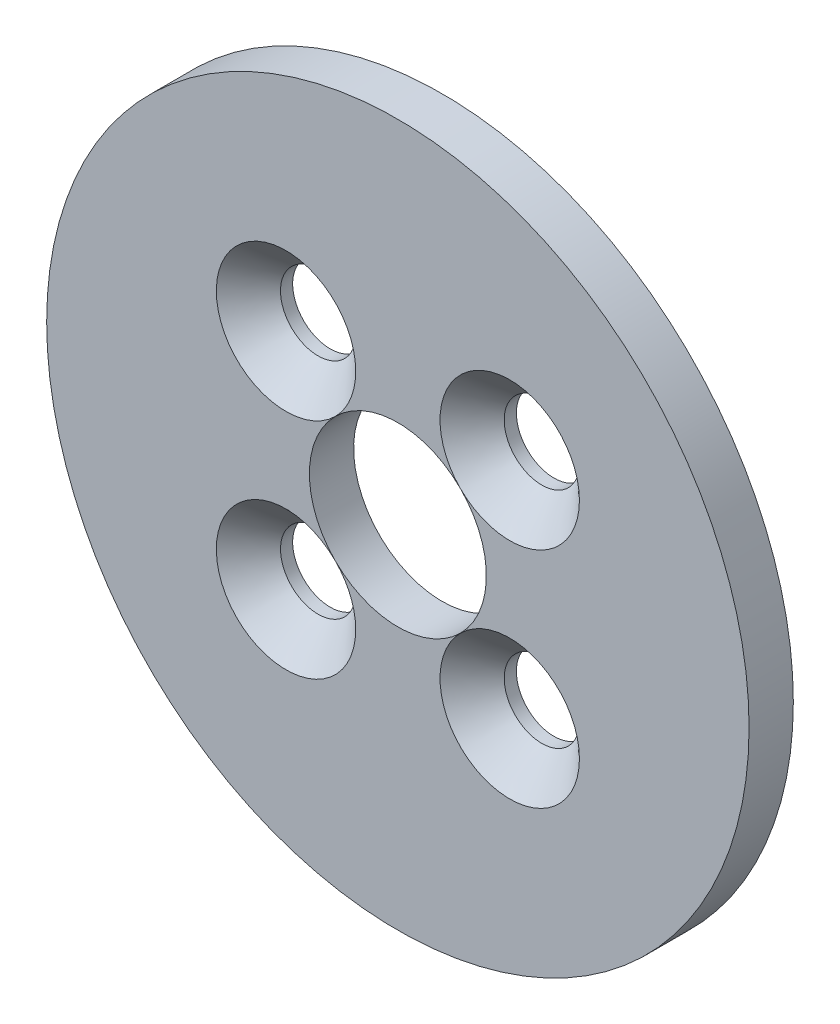
ISO-10303-21;
HEADER;
FILE_DESCRIPTION(('STEP AP214'),'2;1');
FILE_NAME('part.step','',(''),(''),'','','');
FILE_SCHEMA(('AUTOMOTIVE_DESIGN { 1 0 10303 214 1 1 1 1 }'));
ENDSEC;
DATA;
#1=APPLICATION_CONTEXT('core data for automotive mechanical design processes');
#2=APPLICATION_PROTOCOL_DEFINITION('international standard','automotive_design',2000,#1);
#3=PRODUCT_CONTEXT('',#1,'mechanical');
#4=PRODUCT('Part','Part','',(#3));
#5=PRODUCT_RELATED_PRODUCT_CATEGORY('part','',(#4));
#6=PRODUCT_DEFINITION_FORMATION('','',#4);
#7=PRODUCT_DEFINITION_CONTEXT('part definition',#1,'design');
#8=PRODUCT_DEFINITION('design','',#6,#7);
#9=PRODUCT_DEFINITION_SHAPE('','',#8);
#10=(LENGTH_UNIT() NAMED_UNIT(*) SI_UNIT(.MILLI.,.METRE.));
#11=(NAMED_UNIT(*) PLANE_ANGLE_UNIT() SI_UNIT($,.RADIAN.));
#12=(NAMED_UNIT(*) SI_UNIT($,.STERADIAN.) SOLID_ANGLE_UNIT());
#13=UNCERTAINTY_MEASURE_WITH_UNIT(LENGTH_MEASURE(1.E-05),#10,'distance_accuracy_value','');
#14=(GEOMETRIC_REPRESENTATION_CONTEXT(3) GLOBAL_UNCERTAINTY_ASSIGNED_CONTEXT((#13)) GLOBAL_UNIT_ASSIGNED_CONTEXT((#10,
#11,#12)) REPRESENTATION_CONTEXT('',''));
#15=CARTESIAN_POINT('',(0.,0.,0.));
#16=DIRECTION('',(0.,0.,1.));
#17=DIRECTION('',(1.,0.,0.));
#18=AXIS2_PLACEMENT_3D('',#15,#16,#17);
#19=CARTESIAN_POINT('',(-165.662570111801,103.941444968287,2.));
#20=DIRECTION('',(0.,0.,-1.));
#21=DIRECTION('',(-1.,0.,0.));
#22=AXIS2_PLACEMENT_3D('',#19,#20,#21);
#23=CYLINDRICAL_SURFACE('',#22,1.70000000000001);
#24=CARTESIAN_POINT('',(-165.662570111801,103.941444968287,0.));
#25=DIRECTION('',(0.,0.,1.));
#26=DIRECTION('',(1.,0.,0.));
#27=AXIS2_PLACEMENT_3D('',#24,#25,#26);
#28=CIRCLE('',#27,1.70000000000001);
#29=CARTESIAN_POINT('',(-163.962570111801,103.941444968287,0.));
#30=VERTEX_POINT('',#29);
#31=EDGE_CURVE('E100',#30,#30,#28,.T.);
#32=ORIENTED_EDGE('',*,*,#31,.F.);
#33=EDGE_LOOP('',(#32));
#34=FACE_BOUND('',#33,.T.);
#35=CARTESIAN_POINT('',(-165.662570111801,103.941444968287,0.549999999999993));
#36=DIRECTION('',(0.,0.,1.));
#37=DIRECTION('',(1.,0.,0.));
#38=AXIS2_PLACEMENT_3D('',#35,#36,#37);
#39=CIRCLE('',#38,1.69999999999998);
#40=CARTESIAN_POINT('',(-163.962570111801,103.941444968287,0.549999999999993));
#41=VERTEX_POINT('',#40);
#42=EDGE_CURVE('E204',#41,#41,#39,.T.);
#43=ORIENTED_EDGE('',*,*,#42,.T.);
#44=EDGE_LOOP('',(#43));
#45=FACE_BOUND('',#44,.T.);
#46=ADVANCED_FACE('F34',(#34,#45),#23,.F.);
#47=CARTESIAN_POINT('',(-155.550943140833,103.941444968288,2.));
#48=DIRECTION('',(0.,0.,-1.));
#49=DIRECTION('',(-1.,0.,0.));
#50=AXIS2_PLACEMENT_3D('',#47,#48,#49);
#51=CYLINDRICAL_SURFACE('',#50,1.70000000000001);
#52=CARTESIAN_POINT('',(-155.550943140833,103.941444968288,0.));
#53=DIRECTION('',(0.,0.,1.));
#54=DIRECTION('',(1.,0.,0.));
#55=AXIS2_PLACEMENT_3D('',#52,#53,#54);
#56=CIRCLE('',#55,1.70000000000001);
#57=CARTESIAN_POINT('',(-153.850943140833,103.941444968288,0.));
#58=VERTEX_POINT('',#57);
#59=EDGE_CURVE('E94',#58,#58,#56,.T.);
#60=ORIENTED_EDGE('',*,*,#59,.F.);
#61=EDGE_LOOP('',(#60));
#62=FACE_BOUND('',#61,.T.);
#63=CARTESIAN_POINT('',(-155.550943140833,103.941444968288,0.549999999999993));
#64=DIRECTION('',(0.,0.,1.));
#65=DIRECTION('',(1.,0.,0.));
#66=AXIS2_PLACEMENT_3D('',#63,#64,#65);
#67=CIRCLE('',#66,1.69999999999998);
#68=CARTESIAN_POINT('',(-153.850943140833,103.941444968288,0.549999999999993));
#69=VERTEX_POINT('',#68);
#70=EDGE_CURVE('E206',#69,#69,#67,.T.);
#71=ORIENTED_EDGE('',*,*,#70,.T.);
#72=EDGE_LOOP('',(#71));
#73=FACE_BOUND('',#72,.T.);
#74=ADVANCED_FACE('F139',(#62,#73),#51,.F.);
#75=CARTESIAN_POINT('',(-155.550943140833,93.82981799732,2.));
#76=DIRECTION('',(0.,0.,-1.));
#77=DIRECTION('',(-1.,0.,0.));
#78=AXIS2_PLACEMENT_3D('',#75,#76,#77);
#79=CYLINDRICAL_SURFACE('',#78,1.70000000000001);
#80=CARTESIAN_POINT('',(-155.550943140833,93.82981799732,0.));
#81=DIRECTION('',(0.,0.,1.));
#82=DIRECTION('',(1.,0.,0.));
#83=AXIS2_PLACEMENT_3D('',#80,#81,#82);
#84=CIRCLE('',#83,1.70000000000001);
#85=CARTESIAN_POINT('',(-153.850943140833,93.82981799732,0.));
#86=VERTEX_POINT('',#85);
#87=EDGE_CURVE('E91',#86,#86,#84,.T.);
#88=ORIENTED_EDGE('',*,*,#87,.F.);
#89=EDGE_LOOP('',(#88));
#90=FACE_BOUND('',#89,.T.);
#91=CARTESIAN_POINT('',(-155.550943140833,93.82981799732,0.549999999999993));
#92=DIRECTION('',(0.,0.,1.));
#93=DIRECTION('',(1.,0.,0.));
#94=AXIS2_PLACEMENT_3D('',#91,#92,#93);
#95=CIRCLE('',#94,1.69999999999998);
#96=CARTESIAN_POINT('',(-153.850943140833,93.82981799732,0.549999999999993));
#97=VERTEX_POINT('',#96);
#98=EDGE_CURVE('E79',#97,#97,#95,.T.);
#99=ORIENTED_EDGE('',*,*,#98,.T.);
#100=EDGE_LOOP('',(#99));
#101=FACE_BOUND('',#100,.T.);
#102=ADVANCED_FACE('F123',(#90,#101),#79,.F.);
#103=CARTESIAN_POINT('',(-165.6625701118,93.8298179973198,2.));
#104=DIRECTION('',(0.,0.,-1.));
#105=DIRECTION('',(-1.,0.,0.));
#106=AXIS2_PLACEMENT_3D('',#103,#104,#105);
#107=CYLINDRICAL_SURFACE('',#106,1.70000000000001);
#108=CARTESIAN_POINT('',(-165.6625701118,93.8298179973198,0.));
#109=DIRECTION('',(0.,0.,1.));
#110=DIRECTION('',(1.,0.,0.));
#111=AXIS2_PLACEMENT_3D('',#108,#109,#110);
#112=CIRCLE('',#111,1.70000000000001);
#113=CARTESIAN_POINT('',(-163.9625701118,93.8298179973198,0.));
#114=VERTEX_POINT('',#113);
#115=EDGE_CURVE('E82',#114,#114,#112,.T.);
#116=ORIENTED_EDGE('',*,*,#115,.F.);
#117=EDGE_LOOP('',(#116));
#118=FACE_BOUND('',#117,.T.);
#119=CARTESIAN_POINT('',(-165.6625701118,93.8298179973198,0.549999999999993));
#120=DIRECTION('',(0.,0.,1.));
#121=DIRECTION('',(1.,0.,0.));
#122=AXIS2_PLACEMENT_3D('',#119,#120,#121);
#123=CIRCLE('',#122,1.69999999999998);
#124=CARTESIAN_POINT('',(-163.9625701118,93.8298179973198,0.549999999999993));
#125=VERTEX_POINT('',#124);
#126=EDGE_CURVE('E78',#125,#125,#123,.T.);
#127=ORIENTED_EDGE('',*,*,#126,.T.);
#128=EDGE_LOOP('',(#127));
#129=FACE_BOUND('',#128,.T.);
#130=ADVANCED_FACE('F120',(#118,#129),#107,.F.);
#131=CARTESIAN_POINT('',(-160.606756626317,98.8856314828036,2.));
#132=DIRECTION('',(0.,0.,1.));
#133=DIRECTION('',(1.,0.,0.));
#134=AXIS2_PLACEMENT_3D('',#131,#132,#133);
#135=PLANE('',#134);
#136=CARTESIAN_POINT('',(-160.606756626317,98.8856314828036,2.));
#137=DIRECTION('',(0.,0.,1.));
#138=DIRECTION('',(1.,0.,0.));
#139=AXIS2_PLACEMENT_3D('',#136,#137,#138);
#140=CIRCLE('',#139,15.875);
#141=CARTESIAN_POINT('',(-144.731756626317,98.8856314828036,2.));
#142=VERTEX_POINT('',#141);
#143=EDGE_CURVE('E11',#142,#142,#140,.T.);
#144=ORIENTED_EDGE('',*,*,#143,.T.);
#145=EDGE_LOOP('',(#144));
#146=FACE_BOUND('',#145,.T.);
#147=CARTESIAN_POINT('',(-160.606756626317,98.8856314828036,2.));
#148=DIRECTION('',(0.,0.,1.));
#149=DIRECTION('',(1.,0.,0.));
#150=AXIS2_PLACEMENT_3D('',#147,#148,#149);
#151=CIRCLE('',#150,3.99999999999999);
#152=CARTESIAN_POINT('',(-163.435183751065,101.714058607548,2.));
#153=VERTEX_POINT('',#152);
#154=CARTESIAN_POINT('',(-163.435183751064,96.0572043580586,2.));
#155=VERTEX_POINT('',#154);
#156=EDGE_CURVE('E62',#153,#155,#151,.T.);
#157=ORIENTED_EDGE('',*,*,#156,.F.);
#158=CARTESIAN_POINT('',(-165.662570111801,103.941444968287,2.));
#159=DIRECTION('',(0.,0.,1.));
#160=DIRECTION('',(1.,0.,0.));
#161=AXIS2_PLACEMENT_3D('',#158,#159,#160);
#162=CIRCLE('',#161,3.15000000000001);
#163=EDGE_CURVE('E47',#153,#153,#162,.T.);
#164=ORIENTED_EDGE('',*,*,#163,.F.);
#165=CARTESIAN_POINT('',(-157.77832950157,101.714058607549,2.));
#166=VERTEX_POINT('',#165);
#167=EDGE_CURVE('E70',#166,#153,#151,.T.);
#168=ORIENTED_EDGE('',*,*,#167,.F.);
#169=CARTESIAN_POINT('',(-155.550943140833,103.941444968288,2.));
#170=DIRECTION('',(0.,0.,1.));
#171=DIRECTION('',(1.,0.,0.));
#172=AXIS2_PLACEMENT_3D('',#169,#170,#171);
#173=CIRCLE('',#172,3.15000000000001);
#174=EDGE_CURVE('E52',#166,#166,#173,.T.);
#175=ORIENTED_EDGE('',*,*,#174,.F.);
#176=CARTESIAN_POINT('',(-157.778329501571,96.0572043580566,2.));
#177=VERTEX_POINT('',#176);
#178=EDGE_CURVE('E95',#177,#166,#151,.T.);
#179=ORIENTED_EDGE('',*,*,#178,.F.);
#180=CARTESIAN_POINT('',(-155.550943140833,93.82981799732,2.));
#181=DIRECTION('',(0.,0.,1.));
#182=DIRECTION('',(1.,0.,0.));
#183=AXIS2_PLACEMENT_3D('',#180,#181,#182);
#184=CIRCLE('',#183,3.15000000000001);
#185=EDGE_CURVE('E85',#177,#177,#184,.T.);
#186=ORIENTED_EDGE('',*,*,#185,.F.);
#187=EDGE_CURVE('E68',#155,#177,#151,.T.);
#188=ORIENTED_EDGE('',*,*,#187,.F.);
#189=CARTESIAN_POINT('',(-165.6625701118,93.8298179973198,2.));
#190=DIRECTION('',(0.,0.,1.));
#191=DIRECTION('',(1.,0.,0.));
#192=AXIS2_PLACEMENT_3D('',#189,#190,#191);
#193=CIRCLE('',#192,3.14999999999999);
#194=EDGE_CURVE('E76',#155,#155,#193,.T.);
#195=ORIENTED_EDGE('',*,*,#194,.F.);
#196=EDGE_LOOP('',(#157,#164,#168,#175,#179,#186,#188,#195));
#197=FACE_BOUND('',#196,.T.);
#198=ADVANCED_FACE('F110',(#146,#197),#135,.T.);
#199=CARTESIAN_POINT('',(-160.606756626317,98.8856314828036,0.));
#200=DIRECTION('',(0.,0.,1.));
#201=DIRECTION('',(1.,0.,0.));
#202=AXIS2_PLACEMENT_3D('',#199,#200,#201);
#203=PLANE('',#202);
#204=CARTESIAN_POINT('',(-160.606756626317,98.8856314828036,0.));
#205=DIRECTION('',(0.,0.,1.));
#206=DIRECTION('',(1.,0.,0.));
#207=AXIS2_PLACEMENT_3D('',#204,#205,#206);
#208=CIRCLE('',#207,15.875);
#209=CARTESIAN_POINT('',(-144.731756626317,98.8856314828036,0.));
#210=VERTEX_POINT('',#209);
#211=EDGE_CURVE('E38',#210,#210,#208,.T.);
#212=ORIENTED_EDGE('',*,*,#211,.F.);
#213=EDGE_LOOP('',(#212));
#214=FACE_BOUND('',#213,.T.);
#215=ORIENTED_EDGE('',*,*,#31,.T.);
#216=EDGE_LOOP('',(#215));
#217=FACE_BOUND('',#216,.T.);
#218=ORIENTED_EDGE('',*,*,#59,.T.);
#219=EDGE_LOOP('',(#218));
#220=FACE_BOUND('',#219,.T.);
#221=CARTESIAN_POINT('',(-160.606756626317,98.8856314828036,0.));
#222=DIRECTION('',(0.,0.,1.));
#223=DIRECTION('',(1.,0.,0.));
#224=AXIS2_PLACEMENT_3D('',#221,#222,#223);
#225=CIRCLE('',#224,3.99999999999999);
#226=CARTESIAN_POINT('',(-156.606756626317,98.8856314828036,0.));
#227=VERTEX_POINT('',#226);
#228=EDGE_CURVE('E73',#227,#227,#225,.T.);
#229=ORIENTED_EDGE('',*,*,#228,.T.);
#230=EDGE_LOOP('',(#229));
#231=FACE_BOUND('',#230,.T.);
#232=ORIENTED_EDGE('',*,*,#87,.T.);
#233=EDGE_LOOP('',(#232));
#234=FACE_BOUND('',#233,.T.);
#235=ORIENTED_EDGE('',*,*,#115,.T.);
#236=EDGE_LOOP('',(#235));
#237=FACE_BOUND('',#236,.T.);
#238=ADVANCED_FACE('F108',(#214,#217,#220,#231,#234,#237),#203,.F.);
#239=CARTESIAN_POINT('',(-160.606756626317,98.8856314828036,2.));
#240=DIRECTION('',(0.,0.,-1.));
#241=DIRECTION('',(-1.,0.,0.));
#242=AXIS2_PLACEMENT_3D('',#239,#240,#241);
#243=CYLINDRICAL_SURFACE('',#242,15.875);
#244=ORIENTED_EDGE('',*,*,#143,.F.);
#245=EDGE_LOOP('',(#244));
#246=FACE_BOUND('',#245,.T.);
#247=ORIENTED_EDGE('',*,*,#211,.T.);
#248=EDGE_LOOP('',(#247));
#249=FACE_BOUND('',#248,.T.);
#250=ADVANCED_FACE('F36',(#246,#249),#243,.T.);
#251=CARTESIAN_POINT('',(-160.606756626317,98.8856314828036,2.));
#252=DIRECTION('',(0.,0.,-1.));
#253=DIRECTION('',(-1.,0.,0.));
#254=AXIS2_PLACEMENT_3D('',#251,#252,#253);
#255=CYLINDRICAL_SURFACE('',#254,3.99999999999999);
#256=ORIENTED_EDGE('',*,*,#187,.T.);
#257=ORIENTED_EDGE('',*,*,#178,.T.);
#258=ORIENTED_EDGE('',*,*,#167,.T.);
#259=ORIENTED_EDGE('',*,*,#156,.T.);
#260=EDGE_LOOP('',(#256,#257,#258,#259));
#261=FACE_BOUND('',#260,.T.);
#262=ORIENTED_EDGE('',*,*,#228,.F.);
#263=EDGE_LOOP('',(#262));
#264=FACE_BOUND('',#263,.T.);
#265=ADVANCED_FACE('F64',(#261,#264),#255,.F.);
#266=CARTESIAN_POINT('',(-165.6625701118,93.8298179973198,2.));
#267=DIRECTION('',(0.,0.,1.));
#268=DIRECTION('',(1.,0.,0.));
#269=AXIS2_PLACEMENT_3D('',#266,#267,#268);
#270=CONICAL_SURFACE('',#269,3.14999999999999,0.785398163397448);
#271=ORIENTED_EDGE('',*,*,#126,.F.);
#272=EDGE_LOOP('',(#271));
#273=FACE_BOUND('',#272,.T.);
#274=ORIENTED_EDGE('',*,*,#194,.T.);
#275=EDGE_LOOP('',(#274));
#276=FACE_BOUND('',#275,.T.);
#277=ADVANCED_FACE('F77',(#273,#276),#270,.F.);
#278=CARTESIAN_POINT('',(-155.550943140833,93.82981799732,2.));
#279=DIRECTION('',(0.,0.,1.));
#280=DIRECTION('',(1.,0.,0.));
#281=AXIS2_PLACEMENT_3D('',#278,#279,#280);
#282=CONICAL_SURFACE('',#281,3.15000000000001,0.785398163397457);
#283=ORIENTED_EDGE('',*,*,#98,.F.);
#284=EDGE_LOOP('',(#283));
#285=FACE_BOUND('',#284,.T.);
#286=ORIENTED_EDGE('',*,*,#185,.T.);
#287=EDGE_LOOP('',(#286));
#288=FACE_BOUND('',#287,.T.);
#289=ADVANCED_FACE('F128',(#285,#288),#282,.F.);
#290=CARTESIAN_POINT('',(-155.550943140833,103.941444968288,2.));
#291=DIRECTION('',(0.,0.,1.));
#292=DIRECTION('',(1.,0.,0.));
#293=AXIS2_PLACEMENT_3D('',#290,#291,#292);
#294=CONICAL_SURFACE('',#293,3.15000000000001,0.785398163397457);
#295=ORIENTED_EDGE('',*,*,#70,.F.);
#296=EDGE_LOOP('',(#295));
#297=FACE_BOUND('',#296,.T.);
#298=ORIENTED_EDGE('',*,*,#174,.T.);
#299=EDGE_LOOP('',(#298));
#300=FACE_BOUND('',#299,.T.);
#301=ADVANCED_FACE('F134',(#297,#300),#294,.F.);
#302=CARTESIAN_POINT('',(-165.662570111801,103.941444968287,2.));
#303=DIRECTION('',(0.,0.,1.));
#304=DIRECTION('',(1.,0.,0.));
#305=AXIS2_PLACEMENT_3D('',#302,#303,#304);
#306=CONICAL_SURFACE('',#305,3.15000000000001,0.785398163397457);
#307=ORIENTED_EDGE('',*,*,#42,.F.);
#308=EDGE_LOOP('',(#307));
#309=FACE_BOUND('',#308,.T.);
#310=ORIENTED_EDGE('',*,*,#163,.T.);
#311=EDGE_LOOP('',(#310));
#312=FACE_BOUND('',#311,.T.);
#313=ADVANCED_FACE('F188',(#309,#312),#306,.F.);
#314=CLOSED_SHELL('',(#46,#74,#102,#130,#198,#238,#250,#265,#277,#289,#301,#313));
#315=MANIFOLD_SOLID_BREP('B2',#314);
#316=ADVANCED_BREP_SHAPE_REPRESENTATION('',(#18,#315),#14);
#317=SHAPE_DEFINITION_REPRESENTATION(#9,#316);
ENDSEC;
END-ISO-10303-21;
